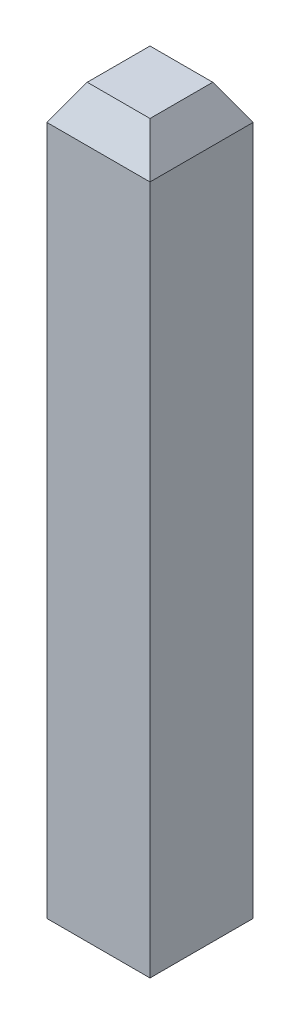
ISO-10303-21;
HEADER;
FILE_DESCRIPTION(('STEP AP214'),'2;1');
FILE_NAME('part.step','',(''),(''),'','','');
FILE_SCHEMA(('AUTOMOTIVE_DESIGN { 1 0 10303 214 1 1 1 1 }'));
ENDSEC;
DATA;
#1=APPLICATION_CONTEXT('core data for automotive mechanical design processes');
#2=APPLICATION_PROTOCOL_DEFINITION('international standard','automotive_design',2000,#1);
#3=PRODUCT_CONTEXT('',#1,'mechanical');
#4=PRODUCT('Part','Part','',(#3));
#5=PRODUCT_RELATED_PRODUCT_CATEGORY('part','',(#4));
#6=PRODUCT_DEFINITION_FORMATION('','',#4);
#7=PRODUCT_DEFINITION_CONTEXT('part definition',#1,'design');
#8=PRODUCT_DEFINITION('design','',#6,#7);
#9=PRODUCT_DEFINITION_SHAPE('','',#8);
#10=(LENGTH_UNIT() NAMED_UNIT(*) SI_UNIT(.MILLI.,.METRE.));
#11=(NAMED_UNIT(*) PLANE_ANGLE_UNIT() SI_UNIT($,.RADIAN.));
#12=(NAMED_UNIT(*) SI_UNIT($,.STERADIAN.) SOLID_ANGLE_UNIT());
#13=UNCERTAINTY_MEASURE_WITH_UNIT(LENGTH_MEASURE(1.E-05),#10,'distance_accuracy_value','');
#14=(GEOMETRIC_REPRESENTATION_CONTEXT(3) GLOBAL_UNCERTAINTY_ASSIGNED_CONTEXT((#13)) GLOBAL_UNIT_ASSIGNED_CONTEXT((#10,
#11,#12)) REPRESENTATION_CONTEXT('',''));
#15=CARTESIAN_POINT('',(0.,0.,0.));
#16=DIRECTION('',(0.,0.,1.));
#17=DIRECTION('',(1.,0.,0.));
#18=AXIS2_PLACEMENT_3D('',#15,#16,#17);
#19=CARTESIAN_POINT('',(-0.93,6.8,0.18));
#20=DIRECTION('',(-1.,0.,0.));
#21=DIRECTION('',(0.,0.,1.));
#22=AXIS2_PLACEMENT_3D('',#19,#20,#21);
#23=PLANE('',#22);
#24=DIRECTION('',(0.,-1.,0.));
#25=VECTOR('',#24,1.);
#26=CARTESIAN_POINT('',(-0.93,6.8,0.18));
#27=LINE('',#26,#25);
#28=CARTESIAN_POINT('',(-0.93,6.58349364905389,0.18));
#29=VERTEX_POINT('',#28);
#30=CARTESIAN_POINT('',(-0.93,2.3,0.18));
#31=VERTEX_POINT('',#30);
#32=EDGE_CURVE('E11',#29,#31,#27,.T.);
#33=ORIENTED_EDGE('',*,*,#32,.F.);
#34=DIRECTION('',(0.,0.,1.));
#35=VECTOR('',#34,1.);
#36=CARTESIAN_POINT('',(-0.93,6.58349364905389,0.18));
#37=LINE('',#36,#35);
#38=CARTESIAN_POINT('',(-0.93,6.58349364905389,0.82));
#39=VERTEX_POINT('',#38);
#40=EDGE_CURVE('E23',#29,#39,#37,.T.);
#41=ORIENTED_EDGE('',*,*,#40,.T.);
#42=DIRECTION('',(0.,-1.,0.));
#43=VECTOR('',#42,1.);
#44=CARTESIAN_POINT('',(-0.93,6.8,0.82));
#45=LINE('',#44,#43);
#46=CARTESIAN_POINT('',(-0.93,2.3,0.82));
#47=VERTEX_POINT('',#46);
#48=EDGE_CURVE('E116',#39,#47,#45,.T.);
#49=ORIENTED_EDGE('',*,*,#48,.T.);
#50=DIRECTION('',(0.,0.,-1.));
#51=VECTOR('',#50,1.);
#52=CARTESIAN_POINT('',(-0.93,2.3,0.18));
#53=LINE('',#52,#51);
#54=EDGE_CURVE('E114',#47,#31,#53,.T.);
#55=ORIENTED_EDGE('',*,*,#54,.T.);
#56=EDGE_LOOP('',(#33,#41,#49,#55));
#57=FACE_BOUND('',#56,.T.);
#58=ADVANCED_FACE('F16',(#57),#23,.F.);
#59=CARTESIAN_POINT('',(-1.57,6.8,0.18));
#60=DIRECTION('',(0.,0.,1.));
#61=DIRECTION('',(1.,0.,0.));
#62=AXIS2_PLACEMENT_3D('',#59,#60,#61);
#63=PLANE('',#62);
#64=DIRECTION('',(0.,-1.,0.));
#65=VECTOR('',#64,1.);
#66=CARTESIAN_POINT('',(-1.57,6.8,0.18));
#67=LINE('',#66,#65);
#68=CARTESIAN_POINT('',(-1.57,6.58349364905389,0.18));
#69=VERTEX_POINT('',#68);
#70=CARTESIAN_POINT('',(-1.57,2.3,0.18));
#71=VERTEX_POINT('',#70);
#72=EDGE_CURVE('E112',#69,#71,#67,.T.);
#73=ORIENTED_EDGE('',*,*,#72,.F.);
#74=DIRECTION('',(1.,0.,0.));
#75=VECTOR('',#74,1.);
#76=CARTESIAN_POINT('',(-1.57,6.58349364905389,0.18));
#77=LINE('',#76,#75);
#78=EDGE_CURVE('E110',#69,#29,#77,.T.);
#79=ORIENTED_EDGE('',*,*,#78,.T.);
#80=ORIENTED_EDGE('',*,*,#32,.T.);
#81=DIRECTION('',(-1.,0.,0.));
#82=VECTOR('',#81,1.);
#83=CARTESIAN_POINT('',(-1.57,2.3,0.18));
#84=LINE('',#83,#82);
#85=EDGE_CURVE('E108',#31,#71,#84,.T.);
#86=ORIENTED_EDGE('',*,*,#85,.T.);
#87=EDGE_LOOP('',(#73,#79,#80,#86));
#88=FACE_BOUND('',#87,.T.);
#89=ADVANCED_FACE('F138',(#88),#63,.F.);
#90=CARTESIAN_POINT('',(-1.57,6.8,0.82));
#91=DIRECTION('',(1.,0.,0.));
#92=DIRECTION('',(0.,0.,-1.));
#93=AXIS2_PLACEMENT_3D('',#90,#91,#92);
#94=PLANE('',#93);
#95=DIRECTION('',(0.,-1.,0.));
#96=VECTOR('',#95,1.);
#97=CARTESIAN_POINT('',(-1.57,6.8,0.82));
#98=LINE('',#97,#96);
#99=CARTESIAN_POINT('',(-1.57,6.58349364905389,0.82));
#100=VERTEX_POINT('',#99);
#101=CARTESIAN_POINT('',(-1.57,2.3,0.82));
#102=VERTEX_POINT('',#101);
#103=EDGE_CURVE('E106',#100,#102,#98,.T.);
#104=ORIENTED_EDGE('',*,*,#103,.F.);
#105=DIRECTION('',(0.,0.,-1.));
#106=VECTOR('',#105,1.);
#107=CARTESIAN_POINT('',(-1.57,6.58349364905389,0.82));
#108=LINE('',#107,#106);
#109=EDGE_CURVE('E103',#100,#69,#108,.T.);
#110=ORIENTED_EDGE('',*,*,#109,.T.);
#111=ORIENTED_EDGE('',*,*,#72,.T.);
#112=DIRECTION('',(0.,0.,1.));
#113=VECTOR('',#112,1.);
#114=CARTESIAN_POINT('',(-1.57,2.3,0.82));
#115=LINE('',#114,#113);
#116=EDGE_CURVE('E100',#71,#102,#115,.T.);
#117=ORIENTED_EDGE('',*,*,#116,.T.);
#118=EDGE_LOOP('',(#104,#110,#111,#117));
#119=FACE_BOUND('',#118,.T.);
#120=ADVANCED_FACE('F133',(#119),#94,.F.);
#121=CARTESIAN_POINT('',(-0.93,6.8,0.82));
#122=DIRECTION('',(0.,0.,-1.));
#123=DIRECTION('',(-1.,0.,0.));
#124=AXIS2_PLACEMENT_3D('',#121,#122,#123);
#125=PLANE('',#124);
#126=ORIENTED_EDGE('',*,*,#48,.F.);
#127=DIRECTION('',(-1.,0.,0.));
#128=VECTOR('',#127,1.);
#129=CARTESIAN_POINT('',(-0.93,6.58349364905389,0.82));
#130=LINE('',#129,#128);
#131=EDGE_CURVE('E97',#39,#100,#130,.T.);
#132=ORIENTED_EDGE('',*,*,#131,.T.);
#133=ORIENTED_EDGE('',*,*,#103,.T.);
#134=DIRECTION('',(1.,0.,0.));
#135=VECTOR('',#134,1.);
#136=CARTESIAN_POINT('',(-0.93,2.3,0.82));
#137=LINE('',#136,#135);
#138=EDGE_CURVE('E94',#102,#47,#137,.T.);
#139=ORIENTED_EDGE('',*,*,#138,.T.);
#140=EDGE_LOOP('',(#126,#132,#133,#139));
#141=FACE_BOUND('',#140,.T.);
#142=ADVANCED_FACE('F121',(#141),#125,.F.);
#143=CARTESIAN_POINT('',(0.,6.8,0.));
#144=DIRECTION('',(0.,-1.,0.));
#145=DIRECTION('',(0.,0.,-1.));
#146=AXIS2_PLACEMENT_3D('',#143,#144,#145);
#147=PLANE('',#146);
#148=DIRECTION('',(0.,0.,1.));
#149=VECTOR('',#148,1.);
#150=CARTESIAN_POINT('',(-1.445,6.8,0.));
#151=LINE('',#150,#149);
#152=CARTESIAN_POINT('',(-1.445,6.8,0.305));
#153=VERTEX_POINT('',#152);
#154=CARTESIAN_POINT('',(-1.445,6.8,0.695));
#155=VERTEX_POINT('',#154);
#156=EDGE_CURVE('E92',#153,#155,#151,.T.);
#157=ORIENTED_EDGE('',*,*,#156,.T.);
#158=DIRECTION('',(1.,0.,0.));
#159=VECTOR('',#158,1.);
#160=CARTESIAN_POINT('',(0.,6.8,0.694999999999999));
#161=LINE('',#160,#159);
#162=CARTESIAN_POINT('',(-1.055,6.8,0.694999999999999));
#163=VERTEX_POINT('',#162);
#164=EDGE_CURVE('E71',#155,#163,#161,.T.);
#165=ORIENTED_EDGE('',*,*,#164,.T.);
#166=DIRECTION('',(0.,0.,-1.));
#167=VECTOR('',#166,1.);
#168=CARTESIAN_POINT('',(-1.055,6.8,0.));
#169=LINE('',#168,#167);
#170=CARTESIAN_POINT('',(-1.055,6.8,0.305));
#171=VERTEX_POINT('',#170);
#172=EDGE_CURVE('E65',#163,#171,#169,.T.);
#173=ORIENTED_EDGE('',*,*,#172,.T.);
#174=DIRECTION('',(-1.,0.,0.));
#175=VECTOR('',#174,1.);
#176=CARTESIAN_POINT('',(0.,6.8,0.305));
#177=LINE('',#176,#175);
#178=EDGE_CURVE('E68',#171,#153,#177,.T.);
#179=ORIENTED_EDGE('',*,*,#178,.T.);
#180=EDGE_LOOP('',(#157,#165,#173,#179));
#181=FACE_BOUND('',#180,.T.);
#182=ADVANCED_FACE('F67',(#181),#147,.F.);
#183=CARTESIAN_POINT('',(0.,2.3,0.));
#184=DIRECTION('',(0.,-1.,0.));
#185=DIRECTION('',(0.,0.,-1.));
#186=AXIS2_PLACEMENT_3D('',#183,#184,#185);
#187=PLANE('',#186);
#188=ORIENTED_EDGE('',*,*,#54,.F.);
#189=ORIENTED_EDGE('',*,*,#138,.F.);
#190=ORIENTED_EDGE('',*,*,#116,.F.);
#191=ORIENTED_EDGE('',*,*,#85,.F.);
#192=EDGE_LOOP('',(#188,#189,#190,#191));
#193=FACE_BOUND('',#192,.T.);
#194=ADVANCED_FACE('F137',(#193),#187,.T.);
#195=CARTESIAN_POINT('',(0.,6.8,0.305));
#196=DIRECTION('',(0.,-0.500000000000004,0.866025403784436));
#197=DIRECTION('',(-1.,0.,0.));
#198=AXIS2_PLACEMENT_3D('',#195,#196,#197);
#199=PLANE('',#198);
#200=DIRECTION('',(-0.447213595499961,0.77459666924148,0.447213595499961));
#201=VECTOR('',#200,1.);
#202=CARTESIAN_POINT('',(-0.994,6.6943449007383,0.244));
#203=LINE('',#202,#201);
#204=EDGE_CURVE('E81',#29,#171,#203,.T.);
#205=ORIENTED_EDGE('',*,*,#204,.F.);
#206=ORIENTED_EDGE('',*,*,#78,.F.);
#207=DIRECTION('',(-0.447213595499961,-0.77459666924148,-0.447213595499961));
#208=VECTOR('',#207,1.);
#209=CARTESIAN_POINT('',(-1.156,7.3005626833874,0.594000000000004));
#210=LINE('',#209,#208);
#211=EDGE_CURVE('E83',#153,#69,#210,.T.);
#212=ORIENTED_EDGE('',*,*,#211,.F.);
#213=ORIENTED_EDGE('',*,*,#178,.F.);
#214=EDGE_LOOP('',(#205,#206,#212,#213));
#215=FACE_BOUND('',#214,.T.);
#216=ADVANCED_FACE('F79',(#215),#199,.F.);
#217=CARTESIAN_POINT('',(-1.445,6.8,0.));
#218=DIRECTION('',(0.866025403784436,-0.500000000000004,0.));
#219=DIRECTION('',(0.,0.,1.));
#220=AXIS2_PLACEMENT_3D('',#217,#218,#219);
#221=PLANE('',#220);
#222=ORIENTED_EDGE('',*,*,#211,.T.);
#223=ORIENTED_EDGE('',*,*,#109,.F.);
#224=DIRECTION('',(-0.447213595499961,-0.77459666924148,0.447213595499961));
#225=VECTOR('',#224,1.);
#226=CARTESIAN_POINT('',(-1.306,7.04075506225207,0.555999999999998));
#227=LINE('',#226,#225);
#228=EDGE_CURVE('E87',#155,#100,#227,.T.);
#229=ORIENTED_EDGE('',*,*,#228,.F.);
#230=ORIENTED_EDGE('',*,*,#156,.F.);
#231=EDGE_LOOP('',(#222,#223,#229,#230));
#232=FACE_BOUND('',#231,.T.);
#233=ADVANCED_FACE('F131',(#232),#221,.F.);
#234=CARTESIAN_POINT('',(-1.055,6.8,0.));
#235=DIRECTION('',(-0.866025403784436,-0.500000000000004,0.));
#236=DIRECTION('',(0.,0.,-1.));
#237=AXIS2_PLACEMENT_3D('',#234,#235,#236);
#238=PLANE('',#237);
#239=ORIENTED_EDGE('',*,*,#204,.T.);
#240=ORIENTED_EDGE('',*,*,#172,.F.);
#241=DIRECTION('',(-0.447213595499961,0.77459666924148,-0.447213595499961));
#242=VECTOR('',#241,1.);
#243=CARTESIAN_POINT('',(-1.194,7.04075506225207,0.555999999999998));
#244=LINE('',#243,#242);
#245=EDGE_CURVE('E126',#39,#163,#244,.T.);
#246=ORIENTED_EDGE('',*,*,#245,.F.);
#247=ORIENTED_EDGE('',*,*,#40,.F.);
#248=EDGE_LOOP('',(#239,#240,#246,#247));
#249=FACE_BOUND('',#248,.T.);
#250=ADVANCED_FACE('F85',(#249),#238,.F.);
#251=CARTESIAN_POINT('',(0.,6.8,0.694999999999999));
#252=DIRECTION('',(0.,-0.500000000000004,-0.866025403784436));
#253=DIRECTION('',(1.,0.,0.));
#254=AXIS2_PLACEMENT_3D('',#251,#252,#253);
#255=PLANE('',#254);
#256=ORIENTED_EDGE('',*,*,#228,.T.);
#257=ORIENTED_EDGE('',*,*,#131,.F.);
#258=ORIENTED_EDGE('',*,*,#245,.T.);
#259=ORIENTED_EDGE('',*,*,#164,.F.);
#260=EDGE_LOOP('',(#256,#257,#258,#259));
#261=FACE_BOUND('',#260,.T.);
#262=ADVANCED_FACE('F125',(#261),#255,.F.);
#263=CLOSED_SHELL('',(#58,#89,#120,#142,#182,#194,#216,#233,#250,#262));
#264=MANIFOLD_SOLID_BREP('B1',#263);
#265=ADVANCED_BREP_SHAPE_REPRESENTATION('',(#18,#264),#14);
#266=SHAPE_DEFINITION_REPRESENTATION(#9,#265);
ENDSEC;
END-ISO-10303-21;
